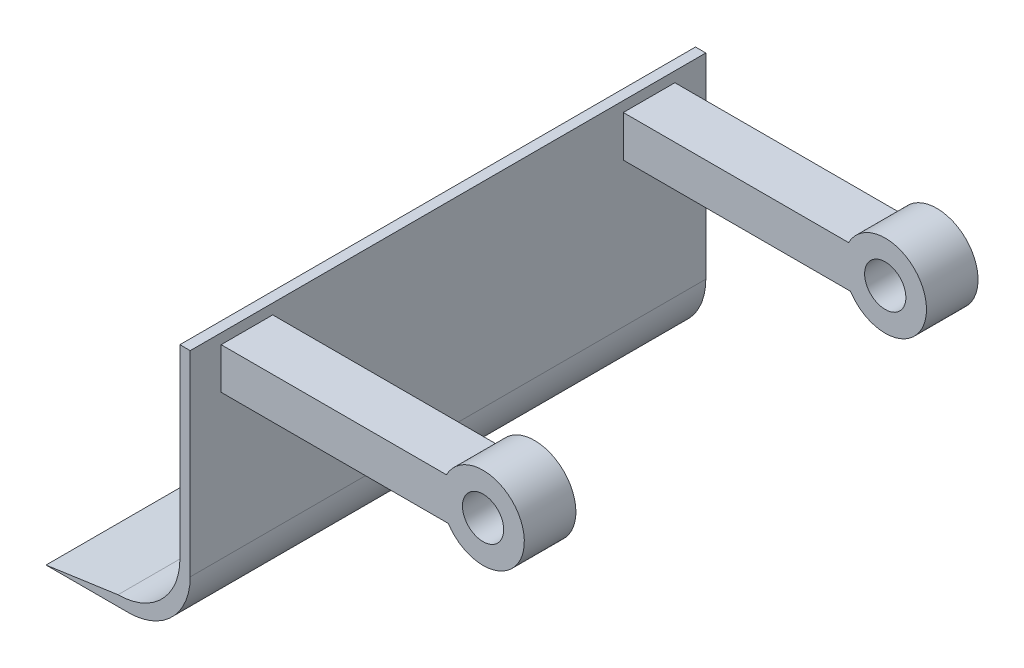
ISO-10303-21;
HEADER;
FILE_DESCRIPTION(('STEP AP214'),'2;1');
FILE_NAME('part.step','',(''),(''),'','','');
FILE_SCHEMA(('AUTOMOTIVE_DESIGN { 1 0 10303 214 1 1 1 1 }'));
ENDSEC;
DATA;
#1=APPLICATION_CONTEXT('core data for automotive mechanical design processes');
#2=APPLICATION_PROTOCOL_DEFINITION('international standard','automotive_design',2000,#1);
#3=PRODUCT_CONTEXT('',#1,'mechanical');
#4=PRODUCT('Part','Part','',(#3));
#5=PRODUCT_RELATED_PRODUCT_CATEGORY('part','',(#4));
#6=PRODUCT_DEFINITION_FORMATION('','',#4);
#7=PRODUCT_DEFINITION_CONTEXT('part definition',#1,'design');
#8=PRODUCT_DEFINITION('design','',#6,#7);
#9=PRODUCT_DEFINITION_SHAPE('','',#8);
#10=(LENGTH_UNIT() NAMED_UNIT(*) SI_UNIT(.MILLI.,.METRE.));
#11=(NAMED_UNIT(*) PLANE_ANGLE_UNIT() SI_UNIT($,.RADIAN.));
#12=(NAMED_UNIT(*) SI_UNIT($,.STERADIAN.) SOLID_ANGLE_UNIT());
#13=UNCERTAINTY_MEASURE_WITH_UNIT(LENGTH_MEASURE(1.E-05),#10,'distance_accuracy_value','');
#14=(GEOMETRIC_REPRESENTATION_CONTEXT(3) GLOBAL_UNCERTAINTY_ASSIGNED_CONTEXT((#13)) GLOBAL_UNIT_ASSIGNED_CONTEXT((#10,
#11,#12)) REPRESENTATION_CONTEXT('',''));
#15=CARTESIAN_POINT('',(0.,0.,0.));
#16=DIRECTION('',(0.,0.,1.));
#17=DIRECTION('',(1.,0.,0.));
#18=AXIS2_PLACEMENT_3D('',#15,#16,#17);
#19=CARTESIAN_POINT('',(0.,0.,250.));
#20=DIRECTION('',(-1.,0.,0.));
#21=DIRECTION('',(0.,0.,1.));
#22=AXIS2_PLACEMENT_3D('',#19,#20,#21);
#23=PLANE('',#22);
#24=DIRECTION('',(0.,-1.,0.));
#25=VECTOR('',#24,1.);
#26=CARTESIAN_POINT('',(0.,120.,235.));
#27=LINE('',#26,#25);
#28=CARTESIAN_POINT('',(0.,120.,235.));
#29=VERTEX_POINT('',#28);
#30=CARTESIAN_POINT('',(0.,100.,235.));
#31=VERTEX_POINT('',#30);
#32=EDGE_CURVE('E171',#29,#31,#27,.T.);
#33=ORIENTED_EDGE('',*,*,#32,.F.);
#34=DIRECTION('',(0.,0.,1.));
#35=VECTOR('',#34,1.);
#36=CARTESIAN_POINT('',(0.,120.,235.));
#37=LINE('',#36,#35);
#38=CARTESIAN_POINT('',(0.,120.,210.));
#39=VERTEX_POINT('',#38);
#40=EDGE_CURVE('E180',#39,#29,#37,.T.);
#41=ORIENTED_EDGE('',*,*,#40,.F.);
#42=DIRECTION('',(0.,1.,0.));
#43=VECTOR('',#42,1.);
#44=CARTESIAN_POINT('',(0.,120.,210.));
#45=LINE('',#44,#43);
#46=CARTESIAN_POINT('',(0.,100.,210.));
#47=VERTEX_POINT('',#46);
#48=EDGE_CURVE('E177',#47,#39,#45,.T.);
#49=ORIENTED_EDGE('',*,*,#48,.F.);
#50=DIRECTION('',(0.,0.,-1.));
#51=VECTOR('',#50,1.);
#52=CARTESIAN_POINT('',(0.,100.,235.));
#53=LINE('',#52,#51);
#54=EDGE_CURVE('E174',#31,#47,#53,.T.);
#55=ORIENTED_EDGE('',*,*,#54,.F.);
#56=EDGE_LOOP('',(#33,#41,#49,#55));
#57=FACE_BOUND('',#56,.T.);
#58=DIRECTION('',(0.,1.,0.));
#59=VECTOR('',#58,1.);
#60=CARTESIAN_POINT('',(0.,0.,0.));
#61=LINE('',#60,#59);
#62=CARTESIAN_POINT('',(0.,30.0000000000002,0.));
#63=VERTEX_POINT('',#62);
#64=CARTESIAN_POINT('',(0.,125.,0.));
#65=VERTEX_POINT('',#64);
#66=EDGE_CURVE('E216',#63,#65,#61,.T.);
#67=ORIENTED_EDGE('',*,*,#66,.T.);
#68=DIRECTION('',(0.,0.,-1.));
#69=VECTOR('',#68,1.);
#70=CARTESIAN_POINT('',(0.,125.,250.));
#71=LINE('',#70,#69);
#72=CARTESIAN_POINT('',(0.,125.,250.));
#73=VERTEX_POINT('',#72);
#74=EDGE_CURVE('E236',#73,#65,#71,.T.);
#75=ORIENTED_EDGE('',*,*,#74,.F.);
#76=DIRECTION('',(0.,1.,0.));
#77=VECTOR('',#76,1.);
#78=CARTESIAN_POINT('',(0.,0.,250.));
#79=LINE('',#78,#77);
#80=CARTESIAN_POINT('',(0.,30.0000000000002,250.));
#81=VERTEX_POINT('',#80);
#82=EDGE_CURVE('E198',#81,#73,#79,.T.);
#83=ORIENTED_EDGE('',*,*,#82,.F.);
#84=DIRECTION('',(0.,0.,-1.));
#85=VECTOR('',#84,1.);
#86=CARTESIAN_POINT('',(0.,30.0000000000002,250.));
#87=LINE('',#86,#85);
#88=EDGE_CURVE('E239',#81,#63,#87,.T.);
#89=ORIENTED_EDGE('',*,*,#88,.T.);
#90=EDGE_LOOP('',(#67,#75,#83,#89));
#91=FACE_BOUND('',#90,.T.);
#92=DIRECTION('',(0.,-1.,0.));
#93=VECTOR('',#92,1.);
#94=CARTESIAN_POINT('',(0.,120.,40.));
#95=LINE('',#94,#93);
#96=CARTESIAN_POINT('',(0.,120.,40.));
#97=VERTEX_POINT('',#96);
#98=CARTESIAN_POINT('',(0.,100.,40.));
#99=VERTEX_POINT('',#98);
#100=EDGE_CURVE('E143',#97,#99,#95,.T.);
#101=ORIENTED_EDGE('',*,*,#100,.F.);
#102=DIRECTION('',(0.,0.,1.));
#103=VECTOR('',#102,1.);
#104=CARTESIAN_POINT('',(0.,120.,40.));
#105=LINE('',#104,#103);
#106=CARTESIAN_POINT('',(0.,120.,15.));
#107=VERTEX_POINT('',#106);
#108=EDGE_CURVE('E150',#107,#97,#105,.T.);
#109=ORIENTED_EDGE('',*,*,#108,.F.);
#110=DIRECTION('',(0.,1.,0.));
#111=VECTOR('',#110,1.);
#112=CARTESIAN_POINT('',(0.,120.,15.));
#113=LINE('',#112,#111);
#114=CARTESIAN_POINT('',(0.,100.,15.));
#115=VERTEX_POINT('',#114);
#116=EDGE_CURVE('E162',#115,#107,#113,.T.);
#117=ORIENTED_EDGE('',*,*,#116,.F.);
#118=DIRECTION('',(0.,0.,-1.));
#119=VECTOR('',#118,1.);
#120=CARTESIAN_POINT('',(0.,100.,40.));
#121=LINE('',#120,#119);
#122=EDGE_CURVE('E157',#99,#115,#121,.T.);
#123=ORIENTED_EDGE('',*,*,#122,.F.);
#124=EDGE_LOOP('',(#101,#109,#117,#123));
#125=FACE_BOUND('',#124,.T.);
#126=ADVANCED_FACE('F35',(#57,#91,#125),#23,.F.);
#127=CARTESIAN_POINT('',(0.,0.,250.));
#128=DIRECTION('',(0.,-1.,0.));
#129=DIRECTION('',(1.,0.,0.));
#130=AXIS2_PLACEMENT_3D('',#127,#128,#129);
#131=PLANE('',#130);
#132=DIRECTION('',(-1.,0.,0.));
#133=VECTOR('',#132,1.);
#134=CARTESIAN_POINT('',(0.,0.,0.));
#135=LINE('',#134,#133);
#136=CARTESIAN_POINT('',(-30.0000000000002,0.,0.));
#137=VERTEX_POINT('',#136);
#138=CARTESIAN_POINT('',(-69.9257938410101,0.,0.));
#139=VERTEX_POINT('',#138);
#140=EDGE_CURVE('E191',#137,#139,#135,.T.);
#141=ORIENTED_EDGE('',*,*,#140,.F.);
#142=DIRECTION('',(0.,0.,-1.));
#143=VECTOR('',#142,1.);
#144=CARTESIAN_POINT('',(-30.0000000000002,0.,250.));
#145=LINE('',#144,#143);
#146=CARTESIAN_POINT('',(-30.0000000000002,0.,250.));
#147=VERTEX_POINT('',#146);
#148=EDGE_CURVE('E242',#147,#137,#145,.T.);
#149=ORIENTED_EDGE('',*,*,#148,.F.);
#150=DIRECTION('',(-1.,0.,0.));
#151=VECTOR('',#150,1.);
#152=CARTESIAN_POINT('',(0.,0.,250.));
#153=LINE('',#152,#151);
#154=CARTESIAN_POINT('',(-69.9257938410101,0.,250.));
#155=VERTEX_POINT('',#154);
#156=EDGE_CURVE('E192',#147,#155,#153,.T.);
#157=ORIENTED_EDGE('',*,*,#156,.T.);
#158=DIRECTION('',(0.,0.,-1.));
#159=VECTOR('',#158,1.);
#160=CARTESIAN_POINT('',(-69.9257938410101,0.,250.));
#161=LINE('',#160,#159);
#162=EDGE_CURVE('E211',#155,#139,#161,.T.);
#163=ORIENTED_EDGE('',*,*,#162,.T.);
#164=EDGE_LOOP('',(#141,#149,#157,#163));
#165=FACE_BOUND('',#164,.T.);
#166=ADVANCED_FACE('F37',(#165),#131,.T.);
#167=CARTESIAN_POINT('',(-30.,30.,250.));
#168=DIRECTION('',(0.,0.,-1.));
#169=DIRECTION('',(-1.,0.,0.));
#170=AXIS2_PLACEMENT_3D('',#167,#168,#169);
#171=CYLINDRICAL_SURFACE('',#170,30.);
#172=CARTESIAN_POINT('',(-30.,30.,0.));
#173=DIRECTION('',(0.,0.,1.));
#174=DIRECTION('',(1.,0.,0.));
#175=AXIS2_PLACEMENT_3D('',#172,#173,#174);
#176=CIRCLE('',#175,30.);
#177=EDGE_CURVE('E214',#137,#63,#176,.T.);
#178=ORIENTED_EDGE('',*,*,#177,.T.);
#179=ORIENTED_EDGE('',*,*,#88,.F.);
#180=CARTESIAN_POINT('',(-30.,30.,250.));
#181=DIRECTION('',(0.,0.,1.));
#182=DIRECTION('',(1.,0.,0.));
#183=AXIS2_PLACEMENT_3D('',#180,#181,#182);
#184=CIRCLE('',#183,30.);
#185=EDGE_CURVE('E195',#147,#81,#184,.T.);
#186=ORIENTED_EDGE('',*,*,#185,.F.);
#187=ORIENTED_EDGE('',*,*,#148,.T.);
#188=EDGE_LOOP('',(#178,#179,#186,#187));
#189=FACE_BOUND('',#188,.T.);
#190=ADVANCED_FACE('F313',(#189),#171,.T.);
#191=CARTESIAN_POINT('',(0.,125.,250.));
#192=DIRECTION('',(0.,-1.,0.));
#193=DIRECTION('',(0.,0.,-1.));
#194=AXIS2_PLACEMENT_3D('',#191,#192,#193);
#195=PLANE('',#194);
#196=DIRECTION('',(-1.,0.,0.));
#197=VECTOR('',#196,1.);
#198=CARTESIAN_POINT('',(0.,125.,0.));
#199=LINE('',#198,#197);
#200=CARTESIAN_POINT('',(-5.,125.,0.));
#201=VERTEX_POINT('',#200);
#202=EDGE_CURVE('E218',#65,#201,#199,.T.);
#203=ORIENTED_EDGE('',*,*,#202,.T.);
#204=DIRECTION('',(0.,0.,-1.));
#205=VECTOR('',#204,1.);
#206=CARTESIAN_POINT('',(-5.,125.,250.));
#207=LINE('',#206,#205);
#208=CARTESIAN_POINT('',(-5.,125.,250.));
#209=VERTEX_POINT('',#208);
#210=EDGE_CURVE('E234',#209,#201,#207,.T.);
#211=ORIENTED_EDGE('',*,*,#210,.F.);
#212=DIRECTION('',(-1.,0.,0.));
#213=VECTOR('',#212,1.);
#214=CARTESIAN_POINT('',(0.,125.,250.));
#215=LINE('',#214,#213);
#216=EDGE_CURVE('E200',#73,#209,#215,.T.);
#217=ORIENTED_EDGE('',*,*,#216,.F.);
#218=ORIENTED_EDGE('',*,*,#74,.T.);
#219=EDGE_LOOP('',(#203,#211,#217,#218));
#220=FACE_BOUND('',#219,.T.);
#221=ADVANCED_FACE('F318',(#220),#195,.F.);
#222=CARTESIAN_POINT('',(-5.,0.,250.));
#223=DIRECTION('',(-1.,0.,0.));
#224=DIRECTION('',(0.,0.,1.));
#225=AXIS2_PLACEMENT_3D('',#222,#223,#224);
#226=PLANE('',#225);
#227=DIRECTION('',(0.,1.,0.));
#228=VECTOR('',#227,1.);
#229=CARTESIAN_POINT('',(-5.,0.,0.));
#230=LINE('',#229,#228);
#231=CARTESIAN_POINT('',(-5.,35.,0.));
#232=VERTEX_POINT('',#231);
#233=EDGE_CURVE('E221',#232,#201,#230,.T.);
#234=ORIENTED_EDGE('',*,*,#233,.F.);
#235=DIRECTION('',(0.,0.,-1.));
#236=VECTOR('',#235,1.);
#237=CARTESIAN_POINT('',(-5.,35.,250.));
#238=LINE('',#237,#236);
#239=CARTESIAN_POINT('',(-5.,35.,250.));
#240=VERTEX_POINT('',#239);
#241=EDGE_CURVE('E232',#240,#232,#238,.T.);
#242=ORIENTED_EDGE('',*,*,#241,.F.);
#243=DIRECTION('',(0.,1.,0.));
#244=VECTOR('',#243,1.);
#245=CARTESIAN_POINT('',(-5.,0.,250.));
#246=LINE('',#245,#244);
#247=EDGE_CURVE('E202',#240,#209,#246,.T.);
#248=ORIENTED_EDGE('',*,*,#247,.T.);
#249=ORIENTED_EDGE('',*,*,#210,.T.);
#250=EDGE_LOOP('',(#234,#242,#248,#249));
#251=FACE_BOUND('',#250,.T.);
#252=ADVANCED_FACE('F325',(#251),#226,.T.);
#253=CARTESIAN_POINT('',(-35.,35.,250.));
#254=DIRECTION('',(0.,0.,-1.));
#255=DIRECTION('',(-1.,0.,0.));
#256=AXIS2_PLACEMENT_3D('',#253,#254,#255);
#257=CYLINDRICAL_SURFACE('',#256,30.);
#258=CARTESIAN_POINT('',(-35.,35.,0.));
#259=DIRECTION('',(0.,0.,1.));
#260=DIRECTION('',(1.,0.,0.));
#261=AXIS2_PLACEMENT_3D('',#258,#259,#260);
#262=CIRCLE('',#261,30.);
#263=CARTESIAN_POINT('',(-35.,4.99999999999999,0.));
#264=VERTEX_POINT('',#263);
#265=EDGE_CURVE('E224',#264,#232,#262,.T.);
#266=ORIENTED_EDGE('',*,*,#265,.F.);
#267=DIRECTION('',(0.,0.,-1.));
#268=VECTOR('',#267,1.);
#269=CARTESIAN_POINT('',(-35.,4.99999999999999,250.));
#270=LINE('',#269,#268);
#271=CARTESIAN_POINT('',(-35.,4.99999999999999,250.));
#272=VERTEX_POINT('',#271);
#273=EDGE_CURVE('E230',#272,#264,#270,.T.);
#274=ORIENTED_EDGE('',*,*,#273,.F.);
#275=CARTESIAN_POINT('',(-35.,35.,250.));
#276=DIRECTION('',(0.,0.,1.));
#277=DIRECTION('',(1.,0.,0.));
#278=AXIS2_PLACEMENT_3D('',#275,#276,#277);
#279=CIRCLE('',#278,30.);
#280=EDGE_CURVE('E205',#272,#240,#279,.T.);
#281=ORIENTED_EDGE('',*,*,#280,.T.);
#282=ORIENTED_EDGE('',*,*,#241,.T.);
#283=EDGE_LOOP('',(#266,#274,#281,#282));
#284=FACE_BOUND('',#283,.T.);
#285=ADVANCED_FACE('F351',(#284),#257,.F.);
#286=CARTESIAN_POINT('',(-1.40434551116824,9.80957636092202,250.));
#287=DIRECTION('',(-0.141715803173192,0.989907385128012,0.));
#288=DIRECTION('',(-0.989907385128012,-0.141715803173192,0.));
#289=AXIS2_PLACEMENT_3D('',#286,#287,#288);
#290=PLANE('',#289);
#291=DIRECTION('',(0.989907385128012,0.141715803173192,0.));
#292=VECTOR('',#291,1.);
#293=CARTESIAN_POINT('',(-1.40434551116824,9.80957636092202,0.));
#294=LINE('',#293,#292);
#295=EDGE_CURVE('E196',#139,#264,#294,.T.);
#296=ORIENTED_EDGE('',*,*,#295,.F.);
#297=ORIENTED_EDGE('',*,*,#162,.F.);
#298=DIRECTION('',(0.989907385128012,0.141715803173192,0.));
#299=VECTOR('',#298,1.);
#300=CARTESIAN_POINT('',(-1.40434551116824,9.80957636092202,250.));
#301=LINE('',#300,#299);
#302=EDGE_CURVE('E208',#155,#272,#301,.T.);
#303=ORIENTED_EDGE('',*,*,#302,.T.);
#304=ORIENTED_EDGE('',*,*,#273,.T.);
#305=EDGE_LOOP('',(#296,#297,#303,#304));
#306=FACE_BOUND('',#305,.T.);
#307=ADVANCED_FACE('F348',(#306),#290,.T.);
#308=CARTESIAN_POINT('',(0.,0.,250.));
#309=DIRECTION('',(0.,0.,1.));
#310=DIRECTION('',(1.,0.,0.));
#311=AXIS2_PLACEMENT_3D('',#308,#309,#310);
#312=PLANE('',#311);
#313=ORIENTED_EDGE('',*,*,#156,.F.);
#314=ORIENTED_EDGE('',*,*,#185,.T.);
#315=ORIENTED_EDGE('',*,*,#82,.T.);
#316=ORIENTED_EDGE('',*,*,#216,.T.);
#317=ORIENTED_EDGE('',*,*,#247,.F.);
#318=ORIENTED_EDGE('',*,*,#280,.F.);
#319=ORIENTED_EDGE('',*,*,#302,.F.);
#320=EDGE_LOOP('',(#313,#314,#315,#316,#317,#318,#319));
#321=FACE_BOUND('',#320,.T.);
#322=ADVANCED_FACE('F343',(#321),#312,.T.);
#323=CARTESIAN_POINT('',(0.,0.,0.));
#324=DIRECTION('',(0.,0.,1.));
#325=DIRECTION('',(1.,0.,0.));
#326=AXIS2_PLACEMENT_3D('',#323,#324,#325);
#327=PLANE('',#326);
#328=ORIENTED_EDGE('',*,*,#140,.T.);
#329=ORIENTED_EDGE('',*,*,#295,.T.);
#330=ORIENTED_EDGE('',*,*,#265,.T.);
#331=ORIENTED_EDGE('',*,*,#233,.T.);
#332=ORIENTED_EDGE('',*,*,#202,.F.);
#333=ORIENTED_EDGE('',*,*,#66,.F.);
#334=ORIENTED_EDGE('',*,*,#177,.F.);
#335=EDGE_LOOP('',(#328,#329,#330,#331,#332,#333,#334));
#336=FACE_BOUND('',#335,.T.);
#337=ADVANCED_FACE('F336',(#336),#327,.F.);
#338=CARTESIAN_POINT('',(125.,120.,235.));
#339=DIRECTION('',(0.,0.,-1.));
#340=DIRECTION('',(-1.,0.,0.));
#341=AXIS2_PLACEMENT_3D('',#338,#339,#340);
#342=PLANE('',#341);
#343=CARTESIAN_POINT('',(127.,110.778032317216,235.));
#344=DIRECTION('',(0.,0.,1.));
#345=DIRECTION('',(1.,0.,0.));
#346=AXIS2_PLACEMENT_3D('',#343,#344,#345);
#347=CIRCLE('',#346,10.);
#348=CARTESIAN_POINT('',(137.,110.778032317216,235.));
#349=VERTEX_POINT('',#348);
#350=EDGE_CURVE('E280',#349,#349,#347,.T.);
#351=ORIENTED_EDGE('',*,*,#350,.F.);
#352=EDGE_LOOP('',(#351));
#353=FACE_BOUND('',#352,.T.);
#354=DIRECTION('',(-1.,0.,0.));
#355=VECTOR('',#354,1.);
#356=CARTESIAN_POINT('',(125.,100.,235.));
#357=LINE('',#356,#355);
#358=CARTESIAN_POINT('',(110.152625742595,100.,235.));
#359=VERTEX_POINT('',#358);
#360=EDGE_CURVE('E189',#359,#31,#357,.T.);
#361=ORIENTED_EDGE('',*,*,#360,.F.);
#362=CARTESIAN_POINT('',(127.,110.778032317216,235.));
#363=DIRECTION('',(0.,0.,1.));
#364=DIRECTION('',(1.,0.,0.));
#365=AXIS2_PLACEMENT_3D('',#362,#363,#364);
#366=CIRCLE('',#365,20.);
#367=CARTESIAN_POINT('',(109.253019635508,120.,235.));
#368=VERTEX_POINT('',#367);
#369=EDGE_CURVE('E260',#359,#368,#366,.T.);
#370=ORIENTED_EDGE('',*,*,#369,.T.);
#371=DIRECTION('',(-1.,0.,0.));
#372=VECTOR('',#371,1.);
#373=CARTESIAN_POINT('',(125.,120.,235.));
#374=LINE('',#373,#372);
#375=EDGE_CURVE('E183',#368,#29,#374,.T.);
#376=ORIENTED_EDGE('',*,*,#375,.T.);
#377=ORIENTED_EDGE('',*,*,#32,.T.);
#378=EDGE_LOOP('',(#361,#370,#376,#377));
#379=FACE_BOUND('',#378,.T.);
#380=ADVANCED_FACE('F363',(#353,#379),#342,.F.);
#381=CARTESIAN_POINT('',(125.,100.,235.));
#382=DIRECTION('',(0.,1.,0.));
#383=DIRECTION('',(0.,0.,1.));
#384=AXIS2_PLACEMENT_3D('',#381,#382,#383);
#385=PLANE('',#384);
#386=DIRECTION('',(-1.,0.,0.));
#387=VECTOR('',#386,1.);
#388=CARTESIAN_POINT('',(125.,100.,210.));
#389=LINE('',#388,#387);
#390=CARTESIAN_POINT('',(110.152625742595,100.,210.));
#391=VERTEX_POINT('',#390);
#392=EDGE_CURVE('E187',#391,#47,#389,.T.);
#393=ORIENTED_EDGE('',*,*,#392,.F.);
#394=DIRECTION('',(0.,0.,1.));
#395=VECTOR('',#394,1.);
#396=CARTESIAN_POINT('',(110.152625742595,100.,153.431457505076));
#397=LINE('',#396,#395);
#398=EDGE_CURVE('E158',#391,#359,#397,.T.);
#399=ORIENTED_EDGE('',*,*,#398,.T.);
#400=ORIENTED_EDGE('',*,*,#360,.T.);
#401=ORIENTED_EDGE('',*,*,#54,.T.);
#402=EDGE_LOOP('',(#393,#399,#400,#401));
#403=FACE_BOUND('',#402,.T.);
#404=ADVANCED_FACE('F368',(#403),#385,.F.);
#405=CARTESIAN_POINT('',(125.,120.,210.));
#406=DIRECTION('',(0.,0.,1.));
#407=DIRECTION('',(1.,0.,0.));
#408=AXIS2_PLACEMENT_3D('',#405,#406,#407);
#409=PLANE('',#408);
#410=CARTESIAN_POINT('',(127.,110.778032317216,210.));
#411=DIRECTION('',(0.,0.,1.));
#412=DIRECTION('',(1.,0.,0.));
#413=AXIS2_PLACEMENT_3D('',#410,#411,#412);
#414=CIRCLE('',#413,10.);
#415=CARTESIAN_POINT('',(137.,110.778032317216,210.));
#416=VERTEX_POINT('',#415);
#417=EDGE_CURVE('E271',#416,#416,#414,.T.);
#418=ORIENTED_EDGE('',*,*,#417,.T.);
#419=EDGE_LOOP('',(#418));
#420=FACE_BOUND('',#419,.T.);
#421=CARTESIAN_POINT('',(127.,110.778032317216,210.));
#422=DIRECTION('',(0.,0.,1.));
#423=DIRECTION('',(1.,0.,0.));
#424=AXIS2_PLACEMENT_3D('',#421,#422,#423);
#425=CIRCLE('',#424,20.);
#426=CARTESIAN_POINT('',(109.253019635508,120.,210.));
#427=VERTEX_POINT('',#426);
#428=EDGE_CURVE('E256',#427,#391,#425,.F.);
#429=ORIENTED_EDGE('',*,*,#428,.T.);
#430=ORIENTED_EDGE('',*,*,#392,.T.);
#431=ORIENTED_EDGE('',*,*,#48,.T.);
#432=DIRECTION('',(-1.,0.,0.));
#433=VECTOR('',#432,1.);
#434=CARTESIAN_POINT('',(125.,120.,210.));
#435=LINE('',#434,#433);
#436=EDGE_CURVE('E185',#427,#39,#435,.T.);
#437=ORIENTED_EDGE('',*,*,#436,.F.);
#438=EDGE_LOOP('',(#429,#430,#431,#437));
#439=FACE_BOUND('',#438,.T.);
#440=ADVANCED_FACE('F255',(#420,#439),#409,.F.);
#441=CARTESIAN_POINT('',(125.,120.,235.));
#442=DIRECTION('',(0.,-1.,0.));
#443=DIRECTION('',(0.,0.,-1.));
#444=AXIS2_PLACEMENT_3D('',#441,#442,#443);
#445=PLANE('',#444);
#446=ORIENTED_EDGE('',*,*,#375,.F.);
#447=DIRECTION('',(0.,0.,1.));
#448=VECTOR('',#447,1.);
#449=CARTESIAN_POINT('',(109.253019635508,120.,153.431457505076));
#450=LINE('',#449,#448);
#451=EDGE_CURVE('E44',#368,#427,#450,.F.);
#452=ORIENTED_EDGE('',*,*,#451,.T.);
#453=ORIENTED_EDGE('',*,*,#436,.T.);
#454=ORIENTED_EDGE('',*,*,#40,.T.);
#455=EDGE_LOOP('',(#446,#452,#453,#454));
#456=FACE_BOUND('',#455,.T.);
#457=ADVANCED_FACE('F247',(#456),#445,.F.);
#458=CARTESIAN_POINT('',(125.,120.,40.));
#459=DIRECTION('',(0.,0.,-1.));
#460=DIRECTION('',(-1.,0.,0.));
#461=AXIS2_PLACEMENT_3D('',#458,#459,#460);
#462=PLANE('',#461);
#463=CARTESIAN_POINT('',(127.,110.778032317216,40.));
#464=DIRECTION('',(0.,0.,-1.));
#465=DIRECTION('',(-1.,0.,0.));
#466=AXIS2_PLACEMENT_3D('',#463,#464,#465);
#467=CIRCLE('',#466,10.);
#468=CARTESIAN_POINT('',(117.,110.778032317216,40.));
#469=VERTEX_POINT('',#468);
#470=EDGE_CURVE('E275',#469,#469,#467,.T.);
#471=ORIENTED_EDGE('',*,*,#470,.T.);
#472=EDGE_LOOP('',(#471));
#473=FACE_BOUND('',#472,.T.);
#474=DIRECTION('',(-1.,0.,0.));
#475=VECTOR('',#474,1.);
#476=CARTESIAN_POINT('',(125.,100.,40.));
#477=LINE('',#476,#475);
#478=CARTESIAN_POINT('',(110.152625742595,100.,40.));
#479=VERTEX_POINT('',#478);
#480=EDGE_CURVE('E169',#479,#99,#477,.T.);
#481=ORIENTED_EDGE('',*,*,#480,.F.);
#482=CARTESIAN_POINT('',(127.,110.778032317216,40.));
#483=DIRECTION('',(0.,0.,1.));
#484=DIRECTION('',(1.,0.,0.));
#485=AXIS2_PLACEMENT_3D('',#482,#483,#484);
#486=CIRCLE('',#485,20.);
#487=CARTESIAN_POINT('',(109.253019635508,120.,40.));
#488=VERTEX_POINT('',#487);
#489=EDGE_CURVE('E145',#479,#488,#486,.T.);
#490=ORIENTED_EDGE('',*,*,#489,.T.);
#491=DIRECTION('',(-1.,0.,0.));
#492=VECTOR('',#491,1.);
#493=CARTESIAN_POINT('',(125.,120.,40.));
#494=LINE('',#493,#492);
#495=EDGE_CURVE('E140',#488,#97,#494,.T.);
#496=ORIENTED_EDGE('',*,*,#495,.T.);
#497=ORIENTED_EDGE('',*,*,#100,.T.);
#498=EDGE_LOOP('',(#481,#490,#496,#497));
#499=FACE_BOUND('',#498,.T.);
#500=ADVANCED_FACE('F142',(#473,#499),#462,.F.);
#501=CARTESIAN_POINT('',(125.,100.,40.));
#502=DIRECTION('',(0.,1.,0.));
#503=DIRECTION('',(0.,0.,1.));
#504=AXIS2_PLACEMENT_3D('',#501,#502,#503);
#505=PLANE('',#504);
#506=DIRECTION('',(-1.,0.,0.));
#507=VECTOR('',#506,1.);
#508=CARTESIAN_POINT('',(125.,100.,15.));
#509=LINE('',#508,#507);
#510=CARTESIAN_POINT('',(110.152625742595,100.,15.));
#511=VERTEX_POINT('',#510);
#512=EDGE_CURVE('E56',#511,#115,#509,.T.);
#513=ORIENTED_EDGE('',*,*,#512,.F.);
#514=DIRECTION('',(0.,0.,1.));
#515=VECTOR('',#514,1.);
#516=CARTESIAN_POINT('',(110.152625742595,100.,-41.5685424949238));
#517=LINE('',#516,#515);
#518=EDGE_CURVE('E51',#511,#479,#517,.T.);
#519=ORIENTED_EDGE('',*,*,#518,.T.);
#520=ORIENTED_EDGE('',*,*,#480,.T.);
#521=ORIENTED_EDGE('',*,*,#122,.T.);
#522=EDGE_LOOP('',(#513,#519,#520,#521));
#523=FACE_BOUND('',#522,.T.);
#524=ADVANCED_FACE('F265',(#523),#505,.F.);
#525=CARTESIAN_POINT('',(125.,120.,15.));
#526=DIRECTION('',(0.,0.,1.));
#527=DIRECTION('',(0.,-1.,0.));
#528=AXIS2_PLACEMENT_3D('',#525,#526,#527);
#529=PLANE('',#528);
#530=CARTESIAN_POINT('',(127.,110.778032317216,15.));
#531=DIRECTION('',(0.,0.,1.));
#532=DIRECTION('',(0.,-1.,0.));
#533=AXIS2_PLACEMENT_3D('',#530,#531,#532);
#534=CIRCLE('',#533,10.);
#535=CARTESIAN_POINT('',(127.,100.778032317216,15.));
#536=VERTEX_POINT('',#535);
#537=EDGE_CURVE('E39',#536,#536,#534,.T.);
#538=ORIENTED_EDGE('',*,*,#537,.T.);
#539=EDGE_LOOP('',(#538));
#540=FACE_BOUND('',#539,.T.);
#541=CARTESIAN_POINT('',(127.,110.778032317216,15.));
#542=DIRECTION('',(0.,0.,1.));
#543=DIRECTION('',(0.,-1.,0.));
#544=AXIS2_PLACEMENT_3D('',#541,#542,#543);
#545=CIRCLE('',#544,20.);
#546=CARTESIAN_POINT('',(109.253019635508,120.,15.));
#547=VERTEX_POINT('',#546);
#548=EDGE_CURVE('E270',#547,#511,#545,.F.);
#549=ORIENTED_EDGE('',*,*,#548,.T.);
#550=ORIENTED_EDGE('',*,*,#512,.T.);
#551=ORIENTED_EDGE('',*,*,#116,.T.);
#552=DIRECTION('',(-1.,0.,0.));
#553=VECTOR('',#552,1.);
#554=CARTESIAN_POINT('',(125.,120.,15.));
#555=LINE('',#554,#553);
#556=EDGE_CURVE('E149',#547,#107,#555,.T.);
#557=ORIENTED_EDGE('',*,*,#556,.F.);
#558=EDGE_LOOP('',(#549,#550,#551,#557));
#559=FACE_BOUND('',#558,.T.);
#560=ADVANCED_FACE('F287',(#540,#559),#529,.F.);
#561=CARTESIAN_POINT('',(125.,120.,40.));
#562=DIRECTION('',(0.,-1.,0.));
#563=DIRECTION('',(0.,0.,-1.));
#564=AXIS2_PLACEMENT_3D('',#561,#562,#563);
#565=PLANE('',#564);
#566=ORIENTED_EDGE('',*,*,#495,.F.);
#567=DIRECTION('',(0.,0.,1.));
#568=VECTOR('',#567,1.);
#569=CARTESIAN_POINT('',(109.253019635508,120.,-41.5685424949238));
#570=LINE('',#569,#568);
#571=EDGE_CURVE('E11',#488,#547,#570,.F.);
#572=ORIENTED_EDGE('',*,*,#571,.T.);
#573=ORIENTED_EDGE('',*,*,#556,.T.);
#574=ORIENTED_EDGE('',*,*,#108,.T.);
#575=EDGE_LOOP('',(#566,#572,#573,#574));
#576=FACE_BOUND('',#575,.T.);
#577=ADVANCED_FACE('F160',(#576),#565,.F.);
#578=CARTESIAN_POINT('',(127.,110.778032317216,153.431457505076));
#579=DIRECTION('',(0.,0.,1.));
#580=DIRECTION('',(1.,0.,0.));
#581=AXIS2_PLACEMENT_3D('',#578,#579,#580);
#582=CYLINDRICAL_SURFACE('',#581,20.);
#583=ORIENTED_EDGE('',*,*,#398,.F.);
#584=ORIENTED_EDGE('',*,*,#428,.F.);
#585=ORIENTED_EDGE('',*,*,#451,.F.);
#586=ORIENTED_EDGE('',*,*,#369,.F.);
#587=EDGE_LOOP('',(#583,#584,#585,#586));
#588=FACE_BOUND('',#587,.T.);
#589=ADVANCED_FACE('F259',(#588),#582,.T.);
#590=CARTESIAN_POINT('',(127.,110.778032317216,-41.5685424949238));
#591=DIRECTION('',(0.,0.,1.));
#592=DIRECTION('',(1.,0.,0.));
#593=AXIS2_PLACEMENT_3D('',#590,#591,#592);
#594=CYLINDRICAL_SURFACE('',#593,20.);
#595=ORIENTED_EDGE('',*,*,#518,.F.);
#596=ORIENTED_EDGE('',*,*,#548,.F.);
#597=ORIENTED_EDGE('',*,*,#571,.F.);
#598=ORIENTED_EDGE('',*,*,#489,.F.);
#599=EDGE_LOOP('',(#595,#596,#597,#598));
#600=FACE_BOUND('',#599,.T.);
#601=ADVANCED_FACE('F267',(#600),#594,.T.);
#602=CARTESIAN_POINT('',(127.,110.778032317216,0.));
#603=DIRECTION('',(0.,0.,1.));
#604=DIRECTION('',(1.,0.,0.));
#605=AXIS2_PLACEMENT_3D('',#602,#603,#604);
#606=CYLINDRICAL_SURFACE('',#605,10.);
#607=ORIENTED_EDGE('',*,*,#537,.F.);
#608=EDGE_LOOP('',(#607));
#609=FACE_BOUND('',#608,.T.);
#610=ORIENTED_EDGE('',*,*,#470,.F.);
#611=EDGE_LOOP('',(#610));
#612=FACE_BOUND('',#611,.T.);
#613=ADVANCED_FACE('F290',(#609,#612),#606,.F.);
#614=ORIENTED_EDGE('',*,*,#350,.T.);
#615=EDGE_LOOP('',(#614));
#616=FACE_BOUND('',#615,.T.);
#617=ORIENTED_EDGE('',*,*,#417,.F.);
#618=EDGE_LOOP('',(#617));
#619=FACE_BOUND('',#618,.T.);
#620=ADVANCED_FACE('F293',(#616,#619),#606,.F.);
#621=CLOSED_SHELL('',(#126,#166,#190,#221,#252,#285,#307,#322,#337,#380,#404,#440,#457,#500,
#524,#560,#577,#589,#601,#613,#620));
#622=MANIFOLD_SOLID_BREP('B2',#621);
#623=ADVANCED_BREP_SHAPE_REPRESENTATION('',(#18,#622),#14);
#624=SHAPE_DEFINITION_REPRESENTATION(#9,#623);
ENDSEC;
END-ISO-10303-21;
